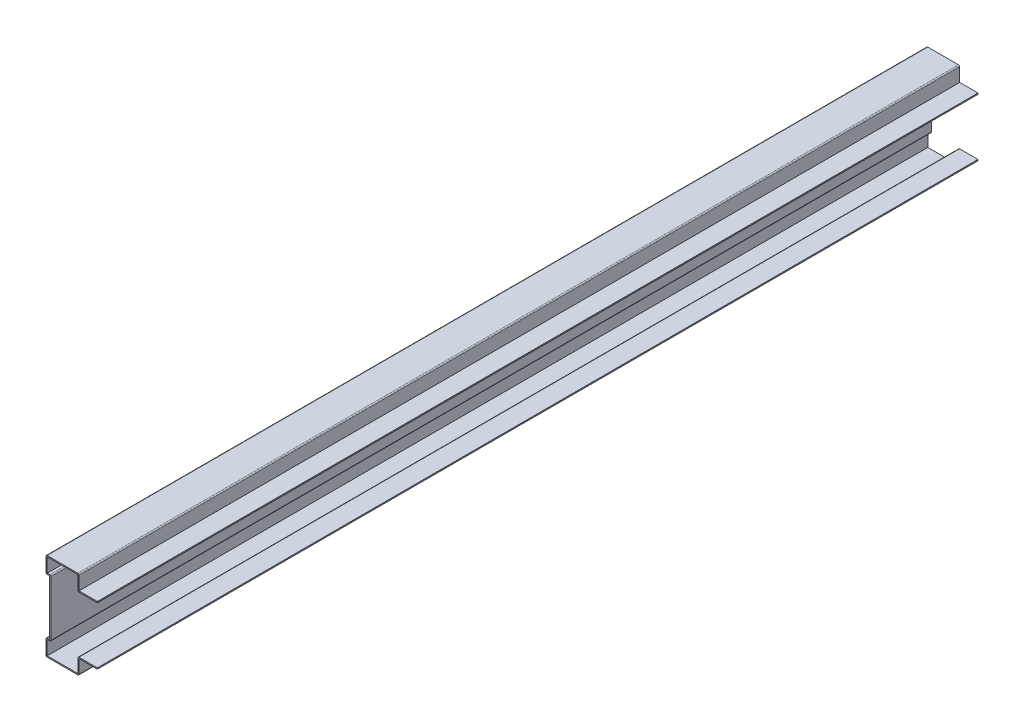
ISO-10303-21;
HEADER;
FILE_DESCRIPTION(('STEP AP214'),'2;1');
FILE_NAME('part.step','',(''),(''),'','','');
FILE_SCHEMA(('AUTOMOTIVE_DESIGN { 1 0 10303 214 1 1 1 1 }'));
ENDSEC;
DATA;
#1=APPLICATION_CONTEXT('core data for automotive mechanical design processes');
#2=APPLICATION_PROTOCOL_DEFINITION('international standard','automotive_design',2000,#1);
#3=PRODUCT_CONTEXT('',#1,'mechanical');
#4=PRODUCT('Part','Part','',(#3));
#5=PRODUCT_RELATED_PRODUCT_CATEGORY('part','',(#4));
#6=PRODUCT_DEFINITION_FORMATION('','',#4);
#7=PRODUCT_DEFINITION_CONTEXT('part definition',#1,'design');
#8=PRODUCT_DEFINITION('design','',#6,#7);
#9=PRODUCT_DEFINITION_SHAPE('','',#8);
#10=(LENGTH_UNIT() NAMED_UNIT(*) SI_UNIT(.MILLI.,.METRE.));
#11=(NAMED_UNIT(*) PLANE_ANGLE_UNIT() SI_UNIT($,.RADIAN.));
#12=(NAMED_UNIT(*) SI_UNIT($,.STERADIAN.) SOLID_ANGLE_UNIT());
#13=UNCERTAINTY_MEASURE_WITH_UNIT(LENGTH_MEASURE(1.E-05),#10,'distance_accuracy_value','');
#14=(GEOMETRIC_REPRESENTATION_CONTEXT(3) GLOBAL_UNCERTAINTY_ASSIGNED_CONTEXT((#13)) GLOBAL_UNIT_ASSIGNED_CONTEXT((#10,
#11,#12)) REPRESENTATION_CONTEXT('',''));
#15=CARTESIAN_POINT('',(0.,0.,0.));
#16=DIRECTION('',(0.,0.,1.));
#17=DIRECTION('',(1.,0.,0.));
#18=AXIS2_PLACEMENT_3D('',#15,#16,#17);
#19=CARTESIAN_POINT('',(-15.875,49.784,-762.));
#20=DIRECTION('',(0.,-1.,0.));
#21=DIRECTION('',(0.,0.,-1.));
#22=AXIS2_PLACEMENT_3D('',#19,#20,#21);
#23=PLANE('',#22);
#24=DIRECTION('',(1.,0.,0.));
#25=VECTOR('',#24,1.);
#26=CARTESIAN_POINT('',(-15.875,49.784,0.));
#27=LINE('',#26,#25);
#28=CARTESIAN_POINT('',(-15.875,49.784,0.));
#29=VERTEX_POINT('',#28);
#30=CARTESIAN_POINT('',(0.,49.784,0.));
#31=VERTEX_POINT('',#30);
#32=EDGE_CURVE('E431',#29,#31,#27,.T.);
#33=ORIENTED_EDGE('',*,*,#32,.F.);
#34=DIRECTION('',(0.,0.,1.));
#35=VECTOR('',#34,1.);
#36=CARTESIAN_POINT('',(-15.875,49.784,-762.));
#37=LINE('',#36,#35);
#38=CARTESIAN_POINT('',(-15.875,49.784,-762.));
#39=VERTEX_POINT('',#38);
#40=EDGE_CURVE('E11',#29,#39,#37,.F.);
#41=ORIENTED_EDGE('',*,*,#40,.T.);
#42=DIRECTION('',(1.,0.,0.));
#43=VECTOR('',#42,1.);
#44=CARTESIAN_POINT('',(-15.875,49.784,-762.));
#45=LINE('',#44,#43);
#46=CARTESIAN_POINT('',(0.,49.784,-762.));
#47=VERTEX_POINT('',#46);
#48=EDGE_CURVE('E257',#39,#47,#45,.T.);
#49=ORIENTED_EDGE('',*,*,#48,.T.);
#50=DIRECTION('',(0.,0.,1.));
#51=VECTOR('',#50,1.);
#52=CARTESIAN_POINT('',(0.,49.784,-762.));
#53=LINE('',#52,#51);
#54=EDGE_CURVE('E261',#47,#31,#53,.T.);
#55=ORIENTED_EDGE('',*,*,#54,.T.);
#56=EDGE_LOOP('',(#33,#41,#49,#55));
#57=FACE_BOUND('',#56,.T.);
#58=ADVANCED_FACE('F35',(#57),#23,.T.);
#59=CARTESIAN_POINT('',(-16.891,63.5,-762.));
#60=DIRECTION('',(-1.,0.,0.));
#61=DIRECTION('',(0.,0.,1.));
#62=AXIS2_PLACEMENT_3D('',#59,#60,#61);
#63=PLANE('',#62);
#64=DIRECTION('',(0.,1.,0.));
#65=VECTOR('',#64,1.);
#66=CARTESIAN_POINT('',(-16.891,63.5,-762.));
#67=LINE('',#66,#65);
#68=CARTESIAN_POINT('',(-16.891,62.484,-762.));
#69=VERTEX_POINT('',#68);
#70=CARTESIAN_POINT('',(-16.891,50.8,-762.));
#71=VERTEX_POINT('',#70);
#72=EDGE_CURVE('E281',#69,#71,#67,.F.);
#73=ORIENTED_EDGE('',*,*,#72,.T.);
#74=DIRECTION('',(0.,0.,1.));
#75=VECTOR('',#74,1.);
#76=CARTESIAN_POINT('',(-16.891,50.8,-762.));
#77=LINE('',#76,#75);
#78=CARTESIAN_POINT('',(-16.891,50.8,0.));
#79=VERTEX_POINT('',#78);
#80=EDGE_CURVE('E43',#71,#79,#77,.T.);
#81=ORIENTED_EDGE('',*,*,#80,.T.);
#82=DIRECTION('',(0.,1.,0.));
#83=VECTOR('',#82,1.);
#84=CARTESIAN_POINT('',(-16.891,63.5,0.));
#85=LINE('',#84,#83);
#86=CARTESIAN_POINT('',(-16.891,62.484,0.));
#87=VERTEX_POINT('',#86);
#88=EDGE_CURVE('E266',#87,#79,#85,.F.);
#89=ORIENTED_EDGE('',*,*,#88,.F.);
#90=DIRECTION('',(0.,0.,1.));
#91=VECTOR('',#90,1.);
#92=CARTESIAN_POINT('',(-16.891,62.484,-762.));
#93=LINE('',#92,#91);
#94=EDGE_CURVE('E294',#69,#87,#93,.T.);
#95=ORIENTED_EDGE('',*,*,#94,.F.);
#96=EDGE_LOOP('',(#73,#81,#89,#95));
#97=FACE_BOUND('',#96,.T.);
#98=ADVANCED_FACE('F378',(#97),#63,.T.);
#99=CARTESIAN_POINT('',(-44.45,62.484,-762.));
#100=DIRECTION('',(0.,-1.,0.));
#101=DIRECTION('',(0.,0.,-1.));
#102=AXIS2_PLACEMENT_3D('',#99,#100,#101);
#103=PLANE('',#102);
#104=DIRECTION('',(1.,0.,0.));
#105=VECTOR('',#104,1.);
#106=CARTESIAN_POINT('',(-44.45,62.484,0.));
#107=LINE('',#106,#105);
#108=CARTESIAN_POINT('',(-43.434,62.484,0.));
#109=VERTEX_POINT('',#108);
#110=EDGE_CURVE('E387',#109,#87,#107,.T.);
#111=ORIENTED_EDGE('',*,*,#110,.F.);
#112=DIRECTION('',(0.,0.,1.));
#113=VECTOR('',#112,1.);
#114=CARTESIAN_POINT('',(-43.434,62.484,-762.));
#115=LINE('',#114,#113);
#116=CARTESIAN_POINT('',(-43.434,62.484,-762.));
#117=VERTEX_POINT('',#116);
#118=EDGE_CURVE('E394',#117,#109,#115,.T.);
#119=ORIENTED_EDGE('',*,*,#118,.F.);
#120=DIRECTION('',(1.,0.,0.));
#121=VECTOR('',#120,1.);
#122=CARTESIAN_POINT('',(-44.45,62.484,-762.));
#123=LINE('',#122,#121);
#124=EDGE_CURVE('E286',#117,#69,#123,.T.);
#125=ORIENTED_EDGE('',*,*,#124,.T.);
#126=ORIENTED_EDGE('',*,*,#94,.T.);
#127=EDGE_LOOP('',(#111,#119,#125,#126));
#128=FACE_BOUND('',#127,.T.);
#129=ADVANCED_FACE('F487',(#128),#103,.T.);
#130=CARTESIAN_POINT('',(-43.434,49.2125,-762.));
#131=DIRECTION('',(1.,0.,0.));
#132=DIRECTION('',(0.,0.,-1.));
#133=AXIS2_PLACEMENT_3D('',#130,#131,#132);
#134=PLANE('',#133);
#135=DIRECTION('',(0.,1.,0.));
#136=VECTOR('',#135,1.);
#137=CARTESIAN_POINT('',(-43.434,49.2125,0.));
#138=LINE('',#137,#136);
#139=CARTESIAN_POINT('',(-43.434,50.2285,0.));
#140=VERTEX_POINT('',#139);
#141=EDGE_CURVE('E389',#140,#109,#138,.T.);
#142=ORIENTED_EDGE('',*,*,#141,.F.);
#143=DIRECTION('',(0.,0.,1.));
#144=VECTOR('',#143,1.);
#145=CARTESIAN_POINT('',(-43.434,50.2285,-762.));
#146=LINE('',#145,#144);
#147=CARTESIAN_POINT('',(-43.434,50.2285,-762.));
#148=VERTEX_POINT('',#147);
#149=EDGE_CURVE('E396',#148,#140,#146,.T.);
#150=ORIENTED_EDGE('',*,*,#149,.F.);
#151=DIRECTION('',(0.,1.,0.));
#152=VECTOR('',#151,1.);
#153=CARTESIAN_POINT('',(-43.434,49.2125,-762.));
#154=LINE('',#153,#152);
#155=EDGE_CURVE('E483',#148,#117,#154,.T.);
#156=ORIENTED_EDGE('',*,*,#155,.T.);
#157=ORIENTED_EDGE('',*,*,#118,.T.);
#158=EDGE_LOOP('',(#142,#150,#156,#157));
#159=FACE_BOUND('',#158,.T.);
#160=ADVANCED_FACE('F480',(#159),#134,.T.);
#161=CARTESIAN_POINT('',(-41.275,50.2285,-762.));
#162=DIRECTION('',(0.,1.,0.));
#163=DIRECTION('',(0.,0.,1.));
#164=AXIS2_PLACEMENT_3D('',#161,#162,#163);
#165=PLANE('',#164);
#166=DIRECTION('',(1.,0.,0.));
#167=VECTOR('',#166,1.);
#168=CARTESIAN_POINT('',(-41.275,50.2285,0.));
#169=LINE('',#168,#167);
#170=CARTESIAN_POINT('',(-41.275,50.2285,0.));
#171=VERTEX_POINT('',#170);
#172=EDGE_CURVE('E475',#171,#140,#169,.F.);
#173=ORIENTED_EDGE('',*,*,#172,.F.);
#174=DIRECTION('',(0.,0.,1.));
#175=VECTOR('',#174,1.);
#176=CARTESIAN_POINT('',(-41.275,50.2285,-762.));
#177=LINE('',#176,#175);
#178=CARTESIAN_POINT('',(-41.275,50.2285,-762.));
#179=VERTEX_POINT('',#178);
#180=EDGE_CURVE('E358',#171,#179,#177,.F.);
#181=ORIENTED_EDGE('',*,*,#180,.T.);
#182=DIRECTION('',(1.,0.,0.));
#183=VECTOR('',#182,1.);
#184=CARTESIAN_POINT('',(-41.275,50.2285,-762.));
#185=LINE('',#184,#183);
#186=EDGE_CURVE('E589',#179,#148,#185,.F.);
#187=ORIENTED_EDGE('',*,*,#186,.T.);
#188=ORIENTED_EDGE('',*,*,#149,.T.);
#189=EDGE_LOOP('',(#173,#181,#187,#188));
#190=FACE_BOUND('',#189,.T.);
#191=ADVANCED_FACE('F593',(#190),#165,.T.);
#192=CARTESIAN_POINT('',(-40.259,1.5875,-762.));
#193=DIRECTION('',(1.,0.,0.));
#194=DIRECTION('',(0.,0.,-1.));
#195=AXIS2_PLACEMENT_3D('',#192,#193,#194);
#196=PLANE('',#195);
#197=DIRECTION('',(0.,1.,0.));
#198=VECTOR('',#197,1.);
#199=CARTESIAN_POINT('',(-40.259,1.5875,0.));
#200=LINE('',#199,#198);
#201=CARTESIAN_POINT('',(-40.259,1.5875,0.));
#202=VERTEX_POINT('',#201);
#203=CARTESIAN_POINT('',(-40.259,49.2125,0.));
#204=VERTEX_POINT('',#203);
#205=EDGE_CURVE('E472',#202,#204,#200,.T.);
#206=ORIENTED_EDGE('',*,*,#205,.F.);
#207=DIRECTION('',(0.,0.,1.));
#208=VECTOR('',#207,1.);
#209=CARTESIAN_POINT('',(-40.259,1.5875,-762.));
#210=LINE('',#209,#208);
#211=CARTESIAN_POINT('',(-40.259,1.5875,-762.));
#212=VERTEX_POINT('',#211);
#213=EDGE_CURVE('E356',#202,#212,#210,.F.);
#214=ORIENTED_EDGE('',*,*,#213,.T.);
#215=DIRECTION('',(0.,1.,0.));
#216=VECTOR('',#215,1.);
#217=CARTESIAN_POINT('',(-40.259,1.5875,-762.));
#218=LINE('',#217,#216);
#219=CARTESIAN_POINT('',(-40.259,49.2125,-762.));
#220=VERTEX_POINT('',#219);
#221=EDGE_CURVE('E586',#212,#220,#218,.T.);
#222=ORIENTED_EDGE('',*,*,#221,.T.);
#223=DIRECTION('',(0.,0.,1.));
#224=VECTOR('',#223,1.);
#225=CARTESIAN_POINT('',(-40.259,49.2125,-762.));
#226=LINE('',#225,#224);
#227=EDGE_CURVE('E353',#220,#204,#226,.T.);
#228=ORIENTED_EDGE('',*,*,#227,.T.);
#229=EDGE_LOOP('',(#206,#214,#222,#228));
#230=FACE_BOUND('',#229,.T.);
#231=ADVANCED_FACE('F600',(#230),#196,.T.);
#232=CARTESIAN_POINT('',(-44.45,0.571499999999999,-762.));
#233=DIRECTION('',(0.,-1.,0.));
#234=DIRECTION('',(0.,0.,-1.));
#235=AXIS2_PLACEMENT_3D('',#232,#233,#234);
#236=PLANE('',#235);
#237=DIRECTION('',(1.,0.,0.));
#238=VECTOR('',#237,1.);
#239=CARTESIAN_POINT('',(-44.45,0.571499999999999,-762.));
#240=LINE('',#239,#238);
#241=CARTESIAN_POINT('',(-43.434,0.571499999999999,-762.));
#242=VERTEX_POINT('',#241);
#243=CARTESIAN_POINT('',(-41.275,0.571499999999999,-762.));
#244=VERTEX_POINT('',#243);
#245=EDGE_CURVE('E583',#242,#244,#240,.T.);
#246=ORIENTED_EDGE('',*,*,#245,.T.);
#247=DIRECTION('',(0.,0.,1.));
#248=VECTOR('',#247,1.);
#249=CARTESIAN_POINT('',(-41.275,0.571499999999999,-762.));
#250=LINE('',#249,#248);
#251=CARTESIAN_POINT('',(-41.275,0.571499999999999,0.));
#252=VERTEX_POINT('',#251);
#253=EDGE_CURVE('E350',#244,#252,#250,.T.);
#254=ORIENTED_EDGE('',*,*,#253,.T.);
#255=DIRECTION('',(1.,0.,0.));
#256=VECTOR('',#255,1.);
#257=CARTESIAN_POINT('',(-44.45,0.571499999999999,0.));
#258=LINE('',#257,#256);
#259=CARTESIAN_POINT('',(-43.434,0.571499999999999,0.));
#260=VERTEX_POINT('',#259);
#261=EDGE_CURVE('E469',#260,#252,#258,.T.);
#262=ORIENTED_EDGE('',*,*,#261,.F.);
#263=DIRECTION('',(0.,0.,1.));
#264=VECTOR('',#263,1.);
#265=CARTESIAN_POINT('',(-43.434,0.571499999999999,-762.));
#266=LINE('',#265,#264);
#267=EDGE_CURVE('E399',#242,#260,#266,.T.);
#268=ORIENTED_EDGE('',*,*,#267,.F.);
#269=EDGE_LOOP('',(#246,#254,#262,#268));
#270=FACE_BOUND('',#269,.T.);
#271=ADVANCED_FACE('F606',(#270),#236,.T.);
#272=CARTESIAN_POINT('',(-43.434,-12.7,-762.));
#273=DIRECTION('',(1.,0.,0.));
#274=DIRECTION('',(0.,0.,-1.));
#275=AXIS2_PLACEMENT_3D('',#272,#273,#274);
#276=PLANE('',#275);
#277=DIRECTION('',(0.,1.,0.));
#278=VECTOR('',#277,1.);
#279=CARTESIAN_POINT('',(-43.434,-12.7,0.));
#280=LINE('',#279,#278);
#281=CARTESIAN_POINT('',(-43.434,-11.684,0.));
#282=VERTEX_POINT('',#281);
#283=EDGE_CURVE('E466',#282,#260,#280,.T.);
#284=ORIENTED_EDGE('',*,*,#283,.F.);
#285=DIRECTION('',(0.,0.,1.));
#286=VECTOR('',#285,1.);
#287=CARTESIAN_POINT('',(-43.434,-11.684,-762.));
#288=LINE('',#287,#286);
#289=CARTESIAN_POINT('',(-43.434,-11.684,-762.));
#290=VERTEX_POINT('',#289);
#291=EDGE_CURVE('E401',#290,#282,#288,.T.);
#292=ORIENTED_EDGE('',*,*,#291,.F.);
#293=DIRECTION('',(0.,1.,0.));
#294=VECTOR('',#293,1.);
#295=CARTESIAN_POINT('',(-43.434,-12.7,-762.));
#296=LINE('',#295,#294);
#297=EDGE_CURVE('E580',#290,#242,#296,.T.);
#298=ORIENTED_EDGE('',*,*,#297,.T.);
#299=ORIENTED_EDGE('',*,*,#267,.T.);
#300=EDGE_LOOP('',(#284,#292,#298,#299));
#301=FACE_BOUND('',#300,.T.);
#302=ADVANCED_FACE('F612',(#301),#276,.T.);
#303=CARTESIAN_POINT('',(-15.875,-11.684,-762.));
#304=DIRECTION('',(0.,1.,0.));
#305=DIRECTION('',(0.,0.,1.));
#306=AXIS2_PLACEMENT_3D('',#303,#304,#305);
#307=PLANE('',#306);
#308=DIRECTION('',(1.,0.,0.));
#309=VECTOR('',#308,1.);
#310=CARTESIAN_POINT('',(-15.875,-11.684,0.));
#311=LINE('',#310,#309);
#312=CARTESIAN_POINT('',(-16.891,-11.684,0.));
#313=VERTEX_POINT('',#312);
#314=EDGE_CURVE('E463',#313,#282,#311,.F.);
#315=ORIENTED_EDGE('',*,*,#314,.F.);
#316=DIRECTION('',(0.,0.,1.));
#317=VECTOR('',#316,1.);
#318=CARTESIAN_POINT('',(-16.891,-11.684,-762.));
#319=LINE('',#318,#317);
#320=CARTESIAN_POINT('',(-16.891,-11.684,-762.));
#321=VERTEX_POINT('',#320);
#322=EDGE_CURVE('E403',#321,#313,#319,.T.);
#323=ORIENTED_EDGE('',*,*,#322,.F.);
#324=DIRECTION('',(1.,0.,0.));
#325=VECTOR('',#324,1.);
#326=CARTESIAN_POINT('',(-15.875,-11.684,-762.));
#327=LINE('',#326,#325);
#328=EDGE_CURVE('E577',#321,#290,#327,.F.);
#329=ORIENTED_EDGE('',*,*,#328,.T.);
#330=ORIENTED_EDGE('',*,*,#291,.T.);
#331=EDGE_LOOP('',(#315,#323,#329,#330));
#332=FACE_BOUND('',#331,.T.);
#333=ADVANCED_FACE('F615',(#332),#307,.T.);
#334=CARTESIAN_POINT('',(-16.891,0.,-762.));
#335=DIRECTION('',(-1.,0.,0.));
#336=DIRECTION('',(0.,-1.,0.));
#337=AXIS2_PLACEMENT_3D('',#334,#335,#336);
#338=PLANE('',#337);
#339=DIRECTION('',(0.,-1.,0.));
#340=VECTOR('',#339,1.);
#341=CARTESIAN_POINT('',(-16.891,0.,0.));
#342=LINE('',#341,#340);
#343=CARTESIAN_POINT('',(-16.891,0.,0.));
#344=VERTEX_POINT('',#343);
#345=EDGE_CURVE('E461',#344,#313,#342,.T.);
#346=ORIENTED_EDGE('',*,*,#345,.F.);
#347=DIRECTION('',(0.,0.,1.));
#348=VECTOR('',#347,1.);
#349=CARTESIAN_POINT('',(-16.891,0.,-762.));
#350=LINE('',#349,#348);
#351=CARTESIAN_POINT('',(-16.891,0.,-762.));
#352=VERTEX_POINT('',#351);
#353=EDGE_CURVE('E314',#344,#352,#350,.F.);
#354=ORIENTED_EDGE('',*,*,#353,.T.);
#355=DIRECTION('',(0.,-1.,0.));
#356=VECTOR('',#355,1.);
#357=CARTESIAN_POINT('',(-16.891,0.,-762.));
#358=LINE('',#357,#356);
#359=EDGE_CURVE('E575',#352,#321,#358,.T.);
#360=ORIENTED_EDGE('',*,*,#359,.T.);
#361=ORIENTED_EDGE('',*,*,#322,.T.);
#362=EDGE_LOOP('',(#346,#354,#360,#361));
#363=FACE_BOUND('',#362,.T.);
#364=ADVANCED_FACE('F707',(#363),#338,.T.);
#365=CARTESIAN_POINT('',(0.,1.016,-762.));
#366=DIRECTION('',(0.,1.,0.));
#367=DIRECTION('',(0.,0.,1.));
#368=AXIS2_PLACEMENT_3D('',#365,#366,#367);
#369=PLANE('',#368);
#370=DIRECTION('',(1.,0.,0.));
#371=VECTOR('',#370,1.);
#372=CARTESIAN_POINT('',(0.,1.016,-762.));
#373=LINE('',#372,#371);
#374=CARTESIAN_POINT('',(0.,1.016,-762.));
#375=VERTEX_POINT('',#374);
#376=CARTESIAN_POINT('',(-15.875,1.016,-762.));
#377=VERTEX_POINT('',#376);
#378=EDGE_CURVE('E572',#375,#377,#373,.F.);
#379=ORIENTED_EDGE('',*,*,#378,.T.);
#380=DIRECTION('',(0.,0.,1.));
#381=VECTOR('',#380,1.);
#382=CARTESIAN_POINT('',(-15.875,1.016,-762.));
#383=LINE('',#382,#381);
#384=CARTESIAN_POINT('',(-15.875,1.016,0.));
#385=VERTEX_POINT('',#384);
#386=EDGE_CURVE('E290',#377,#385,#383,.T.);
#387=ORIENTED_EDGE('',*,*,#386,.T.);
#388=DIRECTION('',(1.,0.,0.));
#389=VECTOR('',#388,1.);
#390=CARTESIAN_POINT('',(0.,1.016,0.));
#391=LINE('',#390,#389);
#392=CARTESIAN_POINT('',(0.,1.016,0.));
#393=VERTEX_POINT('',#392);
#394=EDGE_CURVE('E459',#393,#385,#391,.F.);
#395=ORIENTED_EDGE('',*,*,#394,.F.);
#396=DIRECTION('',(0.,0.,1.));
#397=VECTOR('',#396,1.);
#398=CARTESIAN_POINT('',(0.,1.016,-762.));
#399=LINE('',#398,#397);
#400=EDGE_CURVE('E406',#375,#393,#399,.T.);
#401=ORIENTED_EDGE('',*,*,#400,.F.);
#402=EDGE_LOOP('',(#379,#387,#395,#401));
#403=FACE_BOUND('',#402,.T.);
#404=ADVANCED_FACE('F624',(#403),#369,.T.);
#405=CARTESIAN_POINT('',(0.,1.016,-762.));
#406=DIRECTION('',(-1.,0.,0.));
#407=DIRECTION('',(0.,0.,1.));
#408=AXIS2_PLACEMENT_3D('',#405,#406,#407);
#409=PLANE('',#408);
#410=DIRECTION('',(0.,-1.,0.));
#411=VECTOR('',#410,1.);
#412=CARTESIAN_POINT('',(0.,1.016,0.));
#413=LINE('',#412,#411);
#414=CARTESIAN_POINT('',(0.,0.,0.));
#415=VERTEX_POINT('',#414);
#416=EDGE_CURVE('E457',#393,#415,#413,.T.);
#417=ORIENTED_EDGE('',*,*,#416,.T.);
#418=DIRECTION('',(0.,0.,1.));
#419=VECTOR('',#418,1.);
#420=CARTESIAN_POINT('',(0.,0.,-762.));
#421=LINE('',#420,#419);
#422=CARTESIAN_POINT('',(0.,0.,-762.));
#423=VERTEX_POINT('',#422);
#424=EDGE_CURVE('E408',#423,#415,#421,.T.);
#425=ORIENTED_EDGE('',*,*,#424,.F.);
#426=DIRECTION('',(0.,-1.,0.));
#427=VECTOR('',#426,1.);
#428=CARTESIAN_POINT('',(0.,1.016,-762.));
#429=LINE('',#428,#427);
#430=EDGE_CURVE('E570',#375,#423,#429,.T.);
#431=ORIENTED_EDGE('',*,*,#430,.F.);
#432=ORIENTED_EDGE('',*,*,#400,.T.);
#433=EDGE_LOOP('',(#417,#425,#431,#432));
#434=FACE_BOUND('',#433,.T.);
#435=ADVANCED_FACE('F631',(#434),#409,.F.);
#436=CARTESIAN_POINT('',(0.,0.,-762.));
#437=DIRECTION('',(0.,1.,0.));
#438=DIRECTION('',(0.,0.,1.));
#439=AXIS2_PLACEMENT_3D('',#436,#437,#438);
#440=PLANE('',#439);
#441=DIRECTION('',(-1.,0.,0.));
#442=VECTOR('',#441,1.);
#443=CARTESIAN_POINT('',(0.,0.,0.));
#444=LINE('',#443,#442);
#445=CARTESIAN_POINT('',(-15.875,0.,0.));
#446=VERTEX_POINT('',#445);
#447=EDGE_CURVE('E455',#415,#446,#444,.T.);
#448=ORIENTED_EDGE('',*,*,#447,.T.);
#449=DIRECTION('',(0.,0.,1.));
#450=VECTOR('',#449,1.);
#451=CARTESIAN_POINT('',(-15.875,0.,-762.));
#452=LINE('',#451,#450);
#453=CARTESIAN_POINT('',(-15.875,0.,-762.));
#454=VERTEX_POINT('',#453);
#455=EDGE_CURVE('E411',#454,#446,#452,.T.);
#456=ORIENTED_EDGE('',*,*,#455,.F.);
#457=DIRECTION('',(-1.,0.,0.));
#458=VECTOR('',#457,1.);
#459=CARTESIAN_POINT('',(0.,0.,-762.));
#460=LINE('',#459,#458);
#461=EDGE_CURVE('E568',#423,#454,#460,.T.);
#462=ORIENTED_EDGE('',*,*,#461,.F.);
#463=ORIENTED_EDGE('',*,*,#424,.T.);
#464=EDGE_LOOP('',(#448,#456,#462,#463));
#465=FACE_BOUND('',#464,.T.);
#466=ADVANCED_FACE('F635',(#465),#440,.F.);
#467=CARTESIAN_POINT('',(-15.875,0.,-762.));
#468=DIRECTION('',(-1.,0.,0.));
#469=DIRECTION('',(0.,-1.,0.));
#470=AXIS2_PLACEMENT_3D('',#467,#468,#469);
#471=PLANE('',#470);
#472=DIRECTION('',(0.,-1.,0.));
#473=VECTOR('',#472,1.);
#474=CARTESIAN_POINT('',(-15.875,0.,0.));
#475=LINE('',#474,#473);
#476=CARTESIAN_POINT('',(-15.875,-11.684,0.));
#477=VERTEX_POINT('',#476);
#478=EDGE_CURVE('E452',#446,#477,#475,.T.);
#479=ORIENTED_EDGE('',*,*,#478,.T.);
#480=DIRECTION('',(0.,0.,1.));
#481=VECTOR('',#480,1.);
#482=CARTESIAN_POINT('',(-15.875,-11.684,-762.));
#483=LINE('',#482,#481);
#484=CARTESIAN_POINT('',(-15.875,-11.684,-762.));
#485=VERTEX_POINT('',#484);
#486=EDGE_CURVE('E340',#477,#485,#483,.F.);
#487=ORIENTED_EDGE('',*,*,#486,.T.);
#488=DIRECTION('',(0.,-1.,0.));
#489=VECTOR('',#488,1.);
#490=CARTESIAN_POINT('',(-15.875,0.,-762.));
#491=LINE('',#490,#489);
#492=EDGE_CURVE('E565',#454,#485,#491,.T.);
#493=ORIENTED_EDGE('',*,*,#492,.F.);
#494=ORIENTED_EDGE('',*,*,#455,.T.);
#495=EDGE_LOOP('',(#479,#487,#493,#494));
#496=FACE_BOUND('',#495,.T.);
#497=ADVANCED_FACE('F698',(#496),#471,.F.);
#498=CARTESIAN_POINT('',(-15.875,-12.7,-762.));
#499=DIRECTION('',(0.,1.,0.));
#500=DIRECTION('',(0.,0.,1.));
#501=AXIS2_PLACEMENT_3D('',#498,#499,#500);
#502=PLANE('',#501);
#503=DIRECTION('',(-1.,0.,0.));
#504=VECTOR('',#503,1.);
#505=CARTESIAN_POINT('',(-15.875,-12.7,-762.));
#506=LINE('',#505,#504);
#507=CARTESIAN_POINT('',(-16.891,-12.7,-762.));
#508=VERTEX_POINT('',#507);
#509=CARTESIAN_POINT('',(-43.434,-12.7,-762.));
#510=VERTEX_POINT('',#509);
#511=EDGE_CURVE('E562',#508,#510,#506,.T.);
#512=ORIENTED_EDGE('',*,*,#511,.F.);
#513=DIRECTION('',(0.,0.,1.));
#514=VECTOR('',#513,1.);
#515=CARTESIAN_POINT('',(-16.891,-12.7,-762.));
#516=LINE('',#515,#514);
#517=CARTESIAN_POINT('',(-16.891,-12.7,0.));
#518=VERTEX_POINT('',#517);
#519=EDGE_CURVE('E337',#508,#518,#516,.T.);
#520=ORIENTED_EDGE('',*,*,#519,.T.);
#521=DIRECTION('',(-1.,0.,0.));
#522=VECTOR('',#521,1.);
#523=CARTESIAN_POINT('',(-15.875,-12.7,0.));
#524=LINE('',#523,#522);
#525=CARTESIAN_POINT('',(-43.434,-12.7,0.));
#526=VERTEX_POINT('',#525);
#527=EDGE_CURVE('E449',#518,#526,#524,.T.);
#528=ORIENTED_EDGE('',*,*,#527,.T.);
#529=DIRECTION('',(0.,0.,1.));
#530=VECTOR('',#529,1.);
#531=CARTESIAN_POINT('',(-43.434,-12.7,-762.));
#532=LINE('',#531,#530);
#533=EDGE_CURVE('E335',#526,#510,#532,.F.);
#534=ORIENTED_EDGE('',*,*,#533,.T.);
#535=EDGE_LOOP('',(#512,#520,#528,#534));
#536=FACE_BOUND('',#535,.T.);
#537=ADVANCED_FACE('F645',(#536),#502,.F.);
#538=CARTESIAN_POINT('',(-44.45,-12.7,-762.));
#539=DIRECTION('',(1.,0.,0.));
#540=DIRECTION('',(0.,0.,-1.));
#541=AXIS2_PLACEMENT_3D('',#538,#539,#540);
#542=PLANE('',#541);
#543=DIRECTION('',(0.,1.,0.));
#544=VECTOR('',#543,1.);
#545=CARTESIAN_POINT('',(-44.45,-12.7,-762.));
#546=LINE('',#545,#544);
#547=CARTESIAN_POINT('',(-44.45,-11.684,-762.));
#548=VERTEX_POINT('',#547);
#549=CARTESIAN_POINT('',(-44.45,0.571499999999996,-762.));
#550=VERTEX_POINT('',#549);
#551=EDGE_CURVE('E559',#548,#550,#546,.T.);
#552=ORIENTED_EDGE('',*,*,#551,.F.);
#553=DIRECTION('',(0.,0.,1.));
#554=VECTOR('',#553,1.);
#555=CARTESIAN_POINT('',(-44.45,-11.684,-762.));
#556=LINE('',#555,#554);
#557=CARTESIAN_POINT('',(-44.45,-11.684,0.));
#558=VERTEX_POINT('',#557);
#559=EDGE_CURVE('E344',#548,#558,#556,.T.);
#560=ORIENTED_EDGE('',*,*,#559,.T.);
#561=DIRECTION('',(0.,1.,0.));
#562=VECTOR('',#561,1.);
#563=CARTESIAN_POINT('',(-44.45,-12.7,0.));
#564=LINE('',#563,#562);
#565=CARTESIAN_POINT('',(-44.45,0.571499999999996,0.));
#566=VERTEX_POINT('',#565);
#567=EDGE_CURVE('E446',#558,#566,#564,.T.);
#568=ORIENTED_EDGE('',*,*,#567,.T.);
#569=DIRECTION('',(0.,0.,1.));
#570=VECTOR('',#569,1.);
#571=CARTESIAN_POINT('',(-44.45,0.571499999999999,-762.));
#572=LINE('',#571,#570);
#573=EDGE_CURVE('E342',#566,#550,#572,.F.);
#574=ORIENTED_EDGE('',*,*,#573,.T.);
#575=EDGE_LOOP('',(#552,#560,#568,#574));
#576=FACE_BOUND('',#575,.T.);
#577=ADVANCED_FACE('F652',(#576),#542,.F.);
#578=CARTESIAN_POINT('',(-44.45,1.5875,-762.));
#579=DIRECTION('',(0.,-1.,0.));
#580=DIRECTION('',(0.,0.,-1.));
#581=AXIS2_PLACEMENT_3D('',#578,#579,#580);
#582=PLANE('',#581);
#583=DIRECTION('',(1.,0.,0.));
#584=VECTOR('',#583,1.);
#585=CARTESIAN_POINT('',(-44.45,1.5875,-762.));
#586=LINE('',#585,#584);
#587=CARTESIAN_POINT('',(-43.434,1.5875,-762.));
#588=VERTEX_POINT('',#587);
#589=CARTESIAN_POINT('',(-41.275,1.5875,-762.));
#590=VERTEX_POINT('',#589);
#591=EDGE_CURVE('E557',#588,#590,#586,.T.);
#592=ORIENTED_EDGE('',*,*,#591,.F.);
#593=DIRECTION('',(0.,0.,1.));
#594=VECTOR('',#593,1.);
#595=CARTESIAN_POINT('',(-43.434,1.5875,-762.));
#596=LINE('',#595,#594);
#597=CARTESIAN_POINT('',(-43.434,1.5875,0.));
#598=VERTEX_POINT('',#597);
#599=EDGE_CURVE('E347',#588,#598,#596,.T.);
#600=ORIENTED_EDGE('',*,*,#599,.T.);
#601=DIRECTION('',(1.,0.,0.));
#602=VECTOR('',#601,1.);
#603=CARTESIAN_POINT('',(-44.45,1.5875,0.));
#604=LINE('',#603,#602);
#605=CARTESIAN_POINT('',(-41.275,1.5875,0.));
#606=VERTEX_POINT('',#605);
#607=EDGE_CURVE('E444',#598,#606,#604,.T.);
#608=ORIENTED_EDGE('',*,*,#607,.T.);
#609=DIRECTION('',(0.,0.,1.));
#610=VECTOR('',#609,1.);
#611=CARTESIAN_POINT('',(-41.275,1.5875,-762.));
#612=LINE('',#611,#610);
#613=EDGE_CURVE('E414',#590,#606,#612,.T.);
#614=ORIENTED_EDGE('',*,*,#613,.F.);
#615=EDGE_LOOP('',(#592,#600,#608,#614));
#616=FACE_BOUND('',#615,.T.);
#617=ADVANCED_FACE('F659',(#616),#582,.F.);
#618=CARTESIAN_POINT('',(-41.275,1.5875,-762.));
#619=DIRECTION('',(1.,0.,0.));
#620=DIRECTION('',(0.,0.,-1.));
#621=AXIS2_PLACEMENT_3D('',#618,#619,#620);
#622=PLANE('',#621);
#623=DIRECTION('',(0.,1.,0.));
#624=VECTOR('',#623,1.);
#625=CARTESIAN_POINT('',(-41.275,1.5875,0.));
#626=LINE('',#625,#624);
#627=CARTESIAN_POINT('',(-41.275,49.2125,0.));
#628=VERTEX_POINT('',#627);
#629=EDGE_CURVE('E442',#606,#628,#626,.T.);
#630=ORIENTED_EDGE('',*,*,#629,.T.);
#631=DIRECTION('',(0.,0.,1.));
#632=VECTOR('',#631,1.);
#633=CARTESIAN_POINT('',(-41.275,49.2125,-762.));
#634=LINE('',#633,#632);
#635=CARTESIAN_POINT('',(-41.275,49.2125,-762.));
#636=VERTEX_POINT('',#635);
#637=EDGE_CURVE('E417',#636,#628,#634,.T.);
#638=ORIENTED_EDGE('',*,*,#637,.F.);
#639=DIRECTION('',(0.,1.,0.));
#640=VECTOR('',#639,1.);
#641=CARTESIAN_POINT('',(-41.275,1.5875,-762.));
#642=LINE('',#641,#640);
#643=EDGE_CURVE('E555',#590,#636,#642,.T.);
#644=ORIENTED_EDGE('',*,*,#643,.F.);
#645=ORIENTED_EDGE('',*,*,#613,.T.);
#646=EDGE_LOOP('',(#630,#638,#644,#645));
#647=FACE_BOUND('',#646,.T.);
#648=ADVANCED_FACE('F665',(#647),#622,.F.);
#649=CARTESIAN_POINT('',(-41.275,49.2125,-762.));
#650=DIRECTION('',(0.,1.,0.));
#651=DIRECTION('',(0.,0.,1.));
#652=AXIS2_PLACEMENT_3D('',#649,#650,#651);
#653=PLANE('',#652);
#654=DIRECTION('',(-1.,0.,0.));
#655=VECTOR('',#654,1.);
#656=CARTESIAN_POINT('',(-41.275,49.2125,0.));
#657=LINE('',#656,#655);
#658=CARTESIAN_POINT('',(-43.434,49.2125,0.));
#659=VERTEX_POINT('',#658);
#660=EDGE_CURVE('E439',#628,#659,#657,.T.);
#661=ORIENTED_EDGE('',*,*,#660,.T.);
#662=DIRECTION('',(0.,0.,1.));
#663=VECTOR('',#662,1.);
#664=CARTESIAN_POINT('',(-43.434,49.2125,-762.));
#665=LINE('',#664,#663);
#666=CARTESIAN_POINT('',(-43.434,49.2125,-762.));
#667=VERTEX_POINT('',#666);
#668=EDGE_CURVE('E365',#659,#667,#665,.F.);
#669=ORIENTED_EDGE('',*,*,#668,.T.);
#670=DIRECTION('',(-1.,0.,0.));
#671=VECTOR('',#670,1.);
#672=CARTESIAN_POINT('',(-41.275,49.2125,-762.));
#673=LINE('',#672,#671);
#674=EDGE_CURVE('E548',#636,#667,#673,.T.);
#675=ORIENTED_EDGE('',*,*,#674,.F.);
#676=ORIENTED_EDGE('',*,*,#637,.T.);
#677=EDGE_LOOP('',(#661,#669,#675,#676));
#678=FACE_BOUND('',#677,.T.);
#679=ADVANCED_FACE('F669',(#678),#653,.F.);
#680=CARTESIAN_POINT('',(-44.45,49.2125,-762.));
#681=DIRECTION('',(1.,0.,0.));
#682=DIRECTION('',(0.,0.,-1.));
#683=AXIS2_PLACEMENT_3D('',#680,#681,#682);
#684=PLANE('',#683);
#685=DIRECTION('',(0.,1.,0.));
#686=VECTOR('',#685,1.);
#687=CARTESIAN_POINT('',(-44.45,49.2125,-762.));
#688=LINE('',#687,#686);
#689=CARTESIAN_POINT('',(-44.45,50.2285,-762.));
#690=VERTEX_POINT('',#689);
#691=CARTESIAN_POINT('',(-44.45,62.484,-762.));
#692=VERTEX_POINT('',#691);
#693=EDGE_CURVE('E543',#690,#692,#688,.T.);
#694=ORIENTED_EDGE('',*,*,#693,.F.);
#695=DIRECTION('',(0.,0.,1.));
#696=VECTOR('',#695,1.);
#697=CARTESIAN_POINT('',(-44.45,50.2285,-762.));
#698=LINE('',#697,#696);
#699=CARTESIAN_POINT('',(-44.45,50.2285,0.));
#700=VERTEX_POINT('',#699);
#701=EDGE_CURVE('E362',#690,#700,#698,.T.);
#702=ORIENTED_EDGE('',*,*,#701,.T.);
#703=DIRECTION('',(0.,1.,0.));
#704=VECTOR('',#703,1.);
#705=CARTESIAN_POINT('',(-44.45,49.2125,0.));
#706=LINE('',#705,#704);
#707=CARTESIAN_POINT('',(-44.45,62.484,0.));
#708=VERTEX_POINT('',#707);
#709=EDGE_CURVE('E436',#700,#708,#706,.T.);
#710=ORIENTED_EDGE('',*,*,#709,.T.);
#711=DIRECTION('',(0.,0.,1.));
#712=VECTOR('',#711,1.);
#713=CARTESIAN_POINT('',(-44.45,62.484,-762.));
#714=LINE('',#713,#712);
#715=EDGE_CURVE('E360',#708,#692,#714,.F.);
#716=ORIENTED_EDGE('',*,*,#715,.T.);
#717=EDGE_LOOP('',(#694,#702,#710,#716));
#718=FACE_BOUND('',#717,.T.);
#719=ADVANCED_FACE('F675',(#718),#684,.F.);
#720=CARTESIAN_POINT('',(-44.45,63.5,-762.));
#721=DIRECTION('',(0.,-1.,0.));
#722=DIRECTION('',(0.,0.,-1.));
#723=AXIS2_PLACEMENT_3D('',#720,#721,#722);
#724=PLANE('',#723);
#725=DIRECTION('',(1.,0.,0.));
#726=VECTOR('',#725,1.);
#727=CARTESIAN_POINT('',(-44.45,63.5,-762.));
#728=LINE('',#727,#726);
#729=CARTESIAN_POINT('',(-43.434,63.5,-762.));
#730=VERTEX_POINT('',#729);
#731=CARTESIAN_POINT('',(-16.891,63.5,-762.));
#732=VERTEX_POINT('',#731);
#733=EDGE_CURVE('E541',#730,#732,#728,.T.);
#734=ORIENTED_EDGE('',*,*,#733,.F.);
#735=DIRECTION('',(0.,0.,1.));
#736=VECTOR('',#735,1.);
#737=CARTESIAN_POINT('',(-43.434,63.5,-762.));
#738=LINE('',#737,#736);
#739=CARTESIAN_POINT('',(-43.434,63.5,0.));
#740=VERTEX_POINT('',#739);
#741=EDGE_CURVE('E368',#730,#740,#738,.T.);
#742=ORIENTED_EDGE('',*,*,#741,.T.);
#743=DIRECTION('',(1.,0.,0.));
#744=VECTOR('',#743,1.);
#745=CARTESIAN_POINT('',(-44.45,63.5,0.));
#746=LINE('',#745,#744);
#747=CARTESIAN_POINT('',(-16.891,63.5,0.));
#748=VERTEX_POINT('',#747);
#749=EDGE_CURVE('E429',#740,#748,#746,.T.);
#750=ORIENTED_EDGE('',*,*,#749,.T.);
#751=DIRECTION('',(0.,0.,1.));
#752=VECTOR('',#751,1.);
#753=CARTESIAN_POINT('',(-16.891,63.5,-762.));
#754=LINE('',#753,#752);
#755=EDGE_CURVE('E58',#748,#732,#754,.F.);
#756=ORIENTED_EDGE('',*,*,#755,.T.);
#757=EDGE_LOOP('',(#734,#742,#750,#756));
#758=FACE_BOUND('',#757,.T.);
#759=ADVANCED_FACE('F544',(#758),#724,.F.);
#760=CARTESIAN_POINT('',(-15.875,63.5,-762.));
#761=DIRECTION('',(-1.,0.,0.));
#762=DIRECTION('',(0.,0.,1.));
#763=AXIS2_PLACEMENT_3D('',#760,#761,#762);
#764=PLANE('',#763);
#765=DIRECTION('',(0.,-1.,0.));
#766=VECTOR('',#765,1.);
#767=CARTESIAN_POINT('',(-15.875,63.5,-762.));
#768=LINE('',#767,#766);
#769=CARTESIAN_POINT('',(-15.875,62.484,-762.));
#770=VERTEX_POINT('',#769);
#771=CARTESIAN_POINT('',(-15.875,50.8,-762.));
#772=VERTEX_POINT('',#771);
#773=EDGE_CURVE('E546',#770,#772,#768,.T.);
#774=ORIENTED_EDGE('',*,*,#773,.F.);
#775=DIRECTION('',(0.,0.,1.));
#776=VECTOR('',#775,1.);
#777=CARTESIAN_POINT('',(-15.875,62.484,-762.));
#778=LINE('',#777,#776);
#779=CARTESIAN_POINT('',(-15.875,62.484,0.));
#780=VERTEX_POINT('',#779);
#781=EDGE_CURVE('E371',#770,#780,#778,.T.);
#782=ORIENTED_EDGE('',*,*,#781,.T.);
#783=DIRECTION('',(0.,-1.,0.));
#784=VECTOR('',#783,1.);
#785=CARTESIAN_POINT('',(-15.875,63.5,0.));
#786=LINE('',#785,#784);
#787=CARTESIAN_POINT('',(-15.875,50.8,0.));
#788=VERTEX_POINT('',#787);
#789=EDGE_CURVE('E427',#780,#788,#786,.T.);
#790=ORIENTED_EDGE('',*,*,#789,.T.);
#791=DIRECTION('',(0.,0.,1.));
#792=VECTOR('',#791,1.);
#793=CARTESIAN_POINT('',(-15.875,50.8,-762.));
#794=LINE('',#793,#792);
#795=EDGE_CURVE('E283',#772,#788,#794,.T.);
#796=ORIENTED_EDGE('',*,*,#795,.F.);
#797=EDGE_LOOP('',(#774,#782,#790,#796));
#798=FACE_BOUND('',#797,.T.);
#799=ADVANCED_FACE('F677',(#798),#764,.F.);
#800=CARTESIAN_POINT('',(-15.875,50.8,-762.));
#801=DIRECTION('',(0.,-1.,0.));
#802=DIRECTION('',(0.,0.,-1.));
#803=AXIS2_PLACEMENT_3D('',#800,#801,#802);
#804=PLANE('',#803);
#805=DIRECTION('',(1.,0.,0.));
#806=VECTOR('',#805,1.);
#807=CARTESIAN_POINT('',(-15.875,50.8,0.));
#808=LINE('',#807,#806);
#809=CARTESIAN_POINT('',(0.,50.8,0.));
#810=VERTEX_POINT('',#809);
#811=EDGE_CURVE('E424',#788,#810,#808,.T.);
#812=ORIENTED_EDGE('',*,*,#811,.T.);
#813=DIRECTION('',(0.,0.,1.));
#814=VECTOR('',#813,1.);
#815=CARTESIAN_POINT('',(0.,50.8,-762.));
#816=LINE('',#815,#814);
#817=CARTESIAN_POINT('',(0.,50.8,-762.));
#818=VERTEX_POINT('',#817);
#819=EDGE_CURVE('E280',#818,#810,#816,.T.);
#820=ORIENTED_EDGE('',*,*,#819,.F.);
#821=DIRECTION('',(1.,0.,0.));
#822=VECTOR('',#821,1.);
#823=CARTESIAN_POINT('',(-15.875,50.8,-762.));
#824=LINE('',#823,#822);
#825=EDGE_CURVE('E272',#772,#818,#824,.T.);
#826=ORIENTED_EDGE('',*,*,#825,.F.);
#827=ORIENTED_EDGE('',*,*,#795,.T.);
#828=EDGE_LOOP('',(#812,#820,#826,#827));
#829=FACE_BOUND('',#828,.T.);
#830=ADVANCED_FACE('F423',(#829),#804,.F.);
#831=CARTESIAN_POINT('',(0.,50.8,-762.));
#832=DIRECTION('',(-1.,0.,0.));
#833=DIRECTION('',(0.,0.,1.));
#834=AXIS2_PLACEMENT_3D('',#831,#832,#833);
#835=PLANE('',#834);
#836=DIRECTION('',(0.,-1.,0.));
#837=VECTOR('',#836,1.);
#838=CARTESIAN_POINT('',(0.,50.8,0.));
#839=LINE('',#838,#837);
#840=EDGE_CURVE('E279',#810,#31,#839,.T.);
#841=ORIENTED_EDGE('',*,*,#840,.T.);
#842=ORIENTED_EDGE('',*,*,#54,.F.);
#843=DIRECTION('',(0.,-1.,0.));
#844=VECTOR('',#843,1.);
#845=CARTESIAN_POINT('',(0.,50.8,-762.));
#846=LINE('',#845,#844);
#847=EDGE_CURVE('E265',#818,#47,#846,.T.);
#848=ORIENTED_EDGE('',*,*,#847,.F.);
#849=ORIENTED_EDGE('',*,*,#819,.T.);
#850=EDGE_LOOP('',(#841,#842,#848,#849));
#851=FACE_BOUND('',#850,.T.);
#852=ADVANCED_FACE('F277',(#851),#835,.F.);
#853=CARTESIAN_POINT('',(0.,0.,-762.));
#854=DIRECTION('',(0.,0.,-1.));
#855=DIRECTION('',(-1.,0.,0.));
#856=AXIS2_PLACEMENT_3D('',#853,#854,#855);
#857=PLANE('',#856);
#858=ORIENTED_EDGE('',*,*,#359,.F.);
#859=CARTESIAN_POINT('',(-15.875,0.,-762.));
#860=DIRECTION('',(0.,0.,-1.));
#861=DIRECTION('',(-1.,0.,0.));
#862=AXIS2_PLACEMENT_3D('',#859,#860,#861);
#863=CIRCLE('',#862,1.016);
#864=EDGE_CURVE('E333',#352,#377,#863,.T.);
#865=ORIENTED_EDGE('',*,*,#864,.T.);
#866=ORIENTED_EDGE('',*,*,#378,.F.);
#867=ORIENTED_EDGE('',*,*,#430,.T.);
#868=ORIENTED_EDGE('',*,*,#461,.T.);
#869=ORIENTED_EDGE('',*,*,#492,.T.);
#870=CARTESIAN_POINT('',(-16.891,-11.684,-762.));
#871=DIRECTION('',(0.,0.,-1.));
#872=DIRECTION('',(-1.,0.,0.));
#873=AXIS2_PLACEMENT_3D('',#870,#871,#872);
#874=CIRCLE('',#873,1.016);
#875=EDGE_CURVE('E331',#485,#508,#874,.T.);
#876=ORIENTED_EDGE('',*,*,#875,.T.);
#877=ORIENTED_EDGE('',*,*,#511,.T.);
#878=CARTESIAN_POINT('',(-43.434,-11.684,-762.));
#879=DIRECTION('',(0.,0.,-1.));
#880=DIRECTION('',(-1.,0.,0.));
#881=AXIS2_PLACEMENT_3D('',#878,#879,#880);
#882=CIRCLE('',#881,1.016);
#883=EDGE_CURVE('E329',#510,#548,#882,.T.);
#884=ORIENTED_EDGE('',*,*,#883,.T.);
#885=ORIENTED_EDGE('',*,*,#551,.T.);
#886=CARTESIAN_POINT('',(-43.434,0.571499999999999,-762.));
#887=DIRECTION('',(0.,0.,-1.));
#888=DIRECTION('',(-1.,0.,0.));
#889=AXIS2_PLACEMENT_3D('',#886,#887,#888);
#890=CIRCLE('',#889,1.016);
#891=EDGE_CURVE('E327',#550,#588,#890,.T.);
#892=ORIENTED_EDGE('',*,*,#891,.T.);
#893=ORIENTED_EDGE('',*,*,#591,.T.);
#894=ORIENTED_EDGE('',*,*,#643,.T.);
#895=ORIENTED_EDGE('',*,*,#674,.T.);
#896=CARTESIAN_POINT('',(-43.434,50.2285,-762.));
#897=DIRECTION('',(0.,0.,-1.));
#898=DIRECTION('',(-1.,0.,0.));
#899=AXIS2_PLACEMENT_3D('',#896,#897,#898);
#900=CIRCLE('',#899,1.016);
#901=EDGE_CURVE('E321',#667,#690,#900,.T.);
#902=ORIENTED_EDGE('',*,*,#901,.T.);
#903=ORIENTED_EDGE('',*,*,#693,.T.);
#904=CARTESIAN_POINT('',(-43.434,62.484,-762.));
#905=DIRECTION('',(0.,0.,-1.));
#906=DIRECTION('',(-1.,0.,0.));
#907=AXIS2_PLACEMENT_3D('',#904,#905,#906);
#908=CIRCLE('',#907,1.016);
#909=EDGE_CURVE('E319',#692,#730,#908,.T.);
#910=ORIENTED_EDGE('',*,*,#909,.T.);
#911=ORIENTED_EDGE('',*,*,#733,.T.);
#912=CARTESIAN_POINT('',(-16.891,62.484,-762.));
#913=DIRECTION('',(0.,0.,-1.));
#914=DIRECTION('',(-1.,0.,0.));
#915=AXIS2_PLACEMENT_3D('',#912,#913,#914);
#916=CIRCLE('',#915,1.016);
#917=EDGE_CURVE('E50',#732,#770,#916,.T.);
#918=ORIENTED_EDGE('',*,*,#917,.T.);
#919=ORIENTED_EDGE('',*,*,#773,.T.);
#920=ORIENTED_EDGE('',*,*,#825,.T.);
#921=ORIENTED_EDGE('',*,*,#847,.T.);
#922=ORIENTED_EDGE('',*,*,#48,.F.);
#923=CARTESIAN_POINT('',(-15.875,50.8,-762.));
#924=DIRECTION('',(0.,0.,-1.));
#925=DIRECTION('',(-1.,0.,0.));
#926=AXIS2_PLACEMENT_3D('',#923,#924,#925);
#927=CIRCLE('',#926,1.016);
#928=EDGE_CURVE('E316',#39,#71,#927,.T.);
#929=ORIENTED_EDGE('',*,*,#928,.T.);
#930=ORIENTED_EDGE('',*,*,#72,.F.);
#931=ORIENTED_EDGE('',*,*,#124,.F.);
#932=ORIENTED_EDGE('',*,*,#155,.F.);
#933=ORIENTED_EDGE('',*,*,#186,.F.);
#934=CARTESIAN_POINT('',(-41.275,49.2125,-762.));
#935=DIRECTION('',(0.,0.,-1.));
#936=DIRECTION('',(-1.,0.,0.));
#937=AXIS2_PLACEMENT_3D('',#934,#935,#936);
#938=CIRCLE('',#937,1.016);
#939=EDGE_CURVE('E323',#179,#220,#938,.T.);
#940=ORIENTED_EDGE('',*,*,#939,.T.);
#941=ORIENTED_EDGE('',*,*,#221,.F.);
#942=CARTESIAN_POINT('',(-41.275,1.5875,-762.));
#943=DIRECTION('',(0.,0.,-1.));
#944=DIRECTION('',(-1.,0.,0.));
#945=AXIS2_PLACEMENT_3D('',#942,#943,#944);
#946=CIRCLE('',#945,1.016);
#947=EDGE_CURVE('E325',#212,#244,#946,.T.);
#948=ORIENTED_EDGE('',*,*,#947,.T.);
#949=ORIENTED_EDGE('',*,*,#245,.F.);
#950=ORIENTED_EDGE('',*,*,#297,.F.);
#951=ORIENTED_EDGE('',*,*,#328,.F.);
#952=EDGE_LOOP('',(#858,#865,#866,#867,#868,#869,#876,#877,#884,#885,#892,#893,#894,#895,#902,
#903,#910,#911,#918,#919,#920,#921,#922,#929,#930,#931,#932,#933,#940,#941,#948,#949,#950,#951));
#953=FACE_BOUND('',#952,.T.);
#954=ADVANCED_FACE('F270',(#953),#857,.T.);
#955=CARTESIAN_POINT('',(0.,0.,0.));
#956=DIRECTION('',(0.,0.,-1.));
#957=DIRECTION('',(-1.,0.,0.));
#958=AXIS2_PLACEMENT_3D('',#955,#956,#957);
#959=PLANE('',#958);
#960=ORIENTED_EDGE('',*,*,#394,.T.);
#961=CARTESIAN_POINT('',(-15.875,0.,0.));
#962=DIRECTION('',(0.,0.,-1.));
#963=DIRECTION('',(-1.,0.,0.));
#964=AXIS2_PLACEMENT_3D('',#961,#962,#963);
#965=CIRCLE('',#964,1.016);
#966=EDGE_CURVE('E312',#385,#344,#965,.F.);
#967=ORIENTED_EDGE('',*,*,#966,.T.);
#968=ORIENTED_EDGE('',*,*,#345,.T.);
#969=ORIENTED_EDGE('',*,*,#314,.T.);
#970=ORIENTED_EDGE('',*,*,#283,.T.);
#971=ORIENTED_EDGE('',*,*,#261,.T.);
#972=CARTESIAN_POINT('',(-41.275,1.5875,0.));
#973=DIRECTION('',(0.,0.,-1.));
#974=DIRECTION('',(-1.,0.,0.));
#975=AXIS2_PLACEMENT_3D('',#972,#973,#974);
#976=CIRCLE('',#975,1.016);
#977=EDGE_CURVE('E304',#252,#202,#976,.F.);
#978=ORIENTED_EDGE('',*,*,#977,.T.);
#979=ORIENTED_EDGE('',*,*,#205,.T.);
#980=CARTESIAN_POINT('',(-41.275,49.2125,0.));
#981=DIRECTION('',(0.,0.,-1.));
#982=DIRECTION('',(-1.,0.,0.));
#983=AXIS2_PLACEMENT_3D('',#980,#981,#982);
#984=CIRCLE('',#983,1.016);
#985=EDGE_CURVE('E302',#204,#171,#984,.F.);
#986=ORIENTED_EDGE('',*,*,#985,.T.);
#987=ORIENTED_EDGE('',*,*,#172,.T.);
#988=ORIENTED_EDGE('',*,*,#141,.T.);
#989=ORIENTED_EDGE('',*,*,#110,.T.);
#990=ORIENTED_EDGE('',*,*,#88,.T.);
#991=CARTESIAN_POINT('',(-15.875,50.8,0.));
#992=DIRECTION('',(0.,0.,-1.));
#993=DIRECTION('',(-1.,0.,0.));
#994=AXIS2_PLACEMENT_3D('',#991,#992,#993);
#995=CIRCLE('',#994,1.016);
#996=EDGE_CURVE('E293',#79,#29,#995,.F.);
#997=ORIENTED_EDGE('',*,*,#996,.T.);
#998=ORIENTED_EDGE('',*,*,#32,.T.);
#999=ORIENTED_EDGE('',*,*,#840,.F.);
#1000=ORIENTED_EDGE('',*,*,#811,.F.);
#1001=ORIENTED_EDGE('',*,*,#789,.F.);
#1002=CARTESIAN_POINT('',(-16.891,62.484,0.));
#1003=DIRECTION('',(0.,0.,-1.));
#1004=DIRECTION('',(-1.,0.,0.));
#1005=AXIS2_PLACEMENT_3D('',#1002,#1003,#1004);
#1006=CIRCLE('',#1005,1.016);
#1007=EDGE_CURVE('E296',#780,#748,#1006,.F.);
#1008=ORIENTED_EDGE('',*,*,#1007,.T.);
#1009=ORIENTED_EDGE('',*,*,#749,.F.);
#1010=CARTESIAN_POINT('',(-43.434,62.484,0.));
#1011=DIRECTION('',(0.,0.,-1.));
#1012=DIRECTION('',(-1.,0.,0.));
#1013=AXIS2_PLACEMENT_3D('',#1010,#1011,#1012);
#1014=CIRCLE('',#1013,1.016);
#1015=EDGE_CURVE('E298',#740,#708,#1014,.F.);
#1016=ORIENTED_EDGE('',*,*,#1015,.T.);
#1017=ORIENTED_EDGE('',*,*,#709,.F.);
#1018=CARTESIAN_POINT('',(-43.434,50.2285,0.));
#1019=DIRECTION('',(0.,0.,-1.));
#1020=DIRECTION('',(-1.,0.,0.));
#1021=AXIS2_PLACEMENT_3D('',#1018,#1019,#1020);
#1022=CIRCLE('',#1021,1.016);
#1023=EDGE_CURVE('E300',#700,#659,#1022,.F.);
#1024=ORIENTED_EDGE('',*,*,#1023,.T.);
#1025=ORIENTED_EDGE('',*,*,#660,.F.);
#1026=ORIENTED_EDGE('',*,*,#629,.F.);
#1027=ORIENTED_EDGE('',*,*,#607,.F.);
#1028=CARTESIAN_POINT('',(-43.434,0.571499999999999,0.));
#1029=DIRECTION('',(0.,0.,-1.));
#1030=DIRECTION('',(-1.,0.,0.));
#1031=AXIS2_PLACEMENT_3D('',#1028,#1029,#1030);
#1032=CIRCLE('',#1031,1.016);
#1033=EDGE_CURVE('E306',#598,#566,#1032,.F.);
#1034=ORIENTED_EDGE('',*,*,#1033,.T.);
#1035=ORIENTED_EDGE('',*,*,#567,.F.);
#1036=CARTESIAN_POINT('',(-43.434,-11.684,0.));
#1037=DIRECTION('',(0.,0.,-1.));
#1038=DIRECTION('',(-1.,0.,0.));
#1039=AXIS2_PLACEMENT_3D('',#1036,#1037,#1038);
#1040=CIRCLE('',#1039,1.016);
#1041=EDGE_CURVE('E308',#558,#526,#1040,.F.);
#1042=ORIENTED_EDGE('',*,*,#1041,.T.);
#1043=ORIENTED_EDGE('',*,*,#527,.F.);
#1044=CARTESIAN_POINT('',(-16.891,-11.684,0.));
#1045=DIRECTION('',(0.,0.,-1.));
#1046=DIRECTION('',(-1.,0.,0.));
#1047=AXIS2_PLACEMENT_3D('',#1044,#1045,#1046);
#1048=CIRCLE('',#1047,1.016);
#1049=EDGE_CURVE('E310',#518,#477,#1048,.F.);
#1050=ORIENTED_EDGE('',*,*,#1049,.T.);
#1051=ORIENTED_EDGE('',*,*,#478,.F.);
#1052=ORIENTED_EDGE('',*,*,#447,.F.);
#1053=ORIENTED_EDGE('',*,*,#416,.F.);
#1054=EDGE_LOOP('',(#960,#967,#968,#969,#970,#971,#978,#979,#986,#987,#988,#989,#990,#997,#998,
#999,#1000,#1001,#1008,#1009,#1016,#1017,#1024,#1025,#1026,#1027,#1034,#1035,#1042,#1043,#1050,
#1051,#1052,#1053));
#1055=FACE_BOUND('',#1054,.T.);
#1056=ADVANCED_FACE('F384',(#1055),#959,.F.);
#1057=CARTESIAN_POINT('',(-15.875,0.,-762.));
#1058=DIRECTION('',(0.,0.,1.));
#1059=DIRECTION('',(1.,0.,0.));
#1060=AXIS2_PLACEMENT_3D('',#1057,#1058,#1059);
#1061=CYLINDRICAL_SURFACE('',#1060,1.016);
#1062=ORIENTED_EDGE('',*,*,#864,.F.);
#1063=ORIENTED_EDGE('',*,*,#353,.F.);
#1064=ORIENTED_EDGE('',*,*,#966,.F.);
#1065=ORIENTED_EDGE('',*,*,#386,.F.);
#1066=EDGE_LOOP('',(#1062,#1063,#1064,#1065));
#1067=FACE_BOUND('',#1066,.T.);
#1068=ADVANCED_FACE('F505',(#1067),#1061,.T.);
#1069=CARTESIAN_POINT('',(-16.891,-11.684,-762.));
#1070=DIRECTION('',(0.,0.,1.));
#1071=DIRECTION('',(1.,0.,0.));
#1072=AXIS2_PLACEMENT_3D('',#1069,#1070,#1071);
#1073=CYLINDRICAL_SURFACE('',#1072,1.016);
#1074=ORIENTED_EDGE('',*,*,#875,.F.);
#1075=ORIENTED_EDGE('',*,*,#486,.F.);
#1076=ORIENTED_EDGE('',*,*,#1049,.F.);
#1077=ORIENTED_EDGE('',*,*,#519,.F.);
#1078=EDGE_LOOP('',(#1074,#1075,#1076,#1077));
#1079=FACE_BOUND('',#1078,.T.);
#1080=ADVANCED_FACE('F508',(#1079),#1073,.T.);
#1081=CARTESIAN_POINT('',(-43.434,-11.684,-762.));
#1082=DIRECTION('',(0.,0.,1.));
#1083=DIRECTION('',(1.,0.,0.));
#1084=AXIS2_PLACEMENT_3D('',#1081,#1082,#1083);
#1085=CYLINDRICAL_SURFACE('',#1084,1.016);
#1086=ORIENTED_EDGE('',*,*,#883,.F.);
#1087=ORIENTED_EDGE('',*,*,#533,.F.);
#1088=ORIENTED_EDGE('',*,*,#1041,.F.);
#1089=ORIENTED_EDGE('',*,*,#559,.F.);
#1090=EDGE_LOOP('',(#1086,#1087,#1088,#1089));
#1091=FACE_BOUND('',#1090,.T.);
#1092=ADVANCED_FACE('F512',(#1091),#1085,.T.);
#1093=CARTESIAN_POINT('',(-43.434,0.571499999999999,-762.));
#1094=DIRECTION('',(0.,0.,1.));
#1095=DIRECTION('',(1.,0.,0.));
#1096=AXIS2_PLACEMENT_3D('',#1093,#1094,#1095);
#1097=CYLINDRICAL_SURFACE('',#1096,1.016);
#1098=ORIENTED_EDGE('',*,*,#891,.F.);
#1099=ORIENTED_EDGE('',*,*,#573,.F.);
#1100=ORIENTED_EDGE('',*,*,#1033,.F.);
#1101=ORIENTED_EDGE('',*,*,#599,.F.);
#1102=EDGE_LOOP('',(#1098,#1099,#1100,#1101));
#1103=FACE_BOUND('',#1102,.T.);
#1104=ADVANCED_FACE('F516',(#1103),#1097,.T.);
#1105=CARTESIAN_POINT('',(-41.275,1.5875,-762.));
#1106=DIRECTION('',(0.,0.,1.));
#1107=DIRECTION('',(1.,0.,0.));
#1108=AXIS2_PLACEMENT_3D('',#1105,#1106,#1107);
#1109=CYLINDRICAL_SURFACE('',#1108,1.016);
#1110=ORIENTED_EDGE('',*,*,#947,.F.);
#1111=ORIENTED_EDGE('',*,*,#213,.F.);
#1112=ORIENTED_EDGE('',*,*,#977,.F.);
#1113=ORIENTED_EDGE('',*,*,#253,.F.);
#1114=EDGE_LOOP('',(#1110,#1111,#1112,#1113));
#1115=FACE_BOUND('',#1114,.T.);
#1116=ADVANCED_FACE('F520',(#1115),#1109,.T.);
#1117=CARTESIAN_POINT('',(-41.275,49.2125,-762.));
#1118=DIRECTION('',(0.,0.,1.));
#1119=DIRECTION('',(1.,0.,0.));
#1120=AXIS2_PLACEMENT_3D('',#1117,#1118,#1119);
#1121=CYLINDRICAL_SURFACE('',#1120,1.016);
#1122=ORIENTED_EDGE('',*,*,#939,.F.);
#1123=ORIENTED_EDGE('',*,*,#180,.F.);
#1124=ORIENTED_EDGE('',*,*,#985,.F.);
#1125=ORIENTED_EDGE('',*,*,#227,.F.);
#1126=EDGE_LOOP('',(#1122,#1123,#1124,#1125));
#1127=FACE_BOUND('',#1126,.T.);
#1128=ADVANCED_FACE('F524',(#1127),#1121,.T.);
#1129=CARTESIAN_POINT('',(-43.434,50.2285,-762.));
#1130=DIRECTION('',(0.,0.,1.));
#1131=DIRECTION('',(1.,0.,0.));
#1132=AXIS2_PLACEMENT_3D('',#1129,#1130,#1131);
#1133=CYLINDRICAL_SURFACE('',#1132,1.016);
#1134=ORIENTED_EDGE('',*,*,#901,.F.);
#1135=ORIENTED_EDGE('',*,*,#668,.F.);
#1136=ORIENTED_EDGE('',*,*,#1023,.F.);
#1137=ORIENTED_EDGE('',*,*,#701,.F.);
#1138=EDGE_LOOP('',(#1134,#1135,#1136,#1137));
#1139=FACE_BOUND('',#1138,.T.);
#1140=ADVANCED_FACE('F528',(#1139),#1133,.T.);
#1141=CARTESIAN_POINT('',(-43.434,62.484,-762.));
#1142=DIRECTION('',(0.,0.,1.));
#1143=DIRECTION('',(1.,0.,0.));
#1144=AXIS2_PLACEMENT_3D('',#1141,#1142,#1143);
#1145=CYLINDRICAL_SURFACE('',#1144,1.016);
#1146=ORIENTED_EDGE('',*,*,#909,.F.);
#1147=ORIENTED_EDGE('',*,*,#715,.F.);
#1148=ORIENTED_EDGE('',*,*,#1015,.F.);
#1149=ORIENTED_EDGE('',*,*,#741,.F.);
#1150=EDGE_LOOP('',(#1146,#1147,#1148,#1149));
#1151=FACE_BOUND('',#1150,.T.);
#1152=ADVANCED_FACE('F494',(#1151),#1145,.T.);
#1153=CARTESIAN_POINT('',(-16.891,62.484,-762.));
#1154=DIRECTION('',(0.,0.,1.));
#1155=DIRECTION('',(1.,0.,0.));
#1156=AXIS2_PLACEMENT_3D('',#1153,#1154,#1155);
#1157=CYLINDRICAL_SURFACE('',#1156,1.016);
#1158=ORIENTED_EDGE('',*,*,#917,.F.);
#1159=ORIENTED_EDGE('',*,*,#755,.F.);
#1160=ORIENTED_EDGE('',*,*,#1007,.F.);
#1161=ORIENTED_EDGE('',*,*,#781,.F.);
#1162=EDGE_LOOP('',(#1158,#1159,#1160,#1161));
#1163=FACE_BOUND('',#1162,.T.);
#1164=ADVANCED_FACE('F490',(#1163),#1157,.T.);
#1165=CARTESIAN_POINT('',(-15.875,50.8,-762.));
#1166=DIRECTION('',(0.,0.,1.));
#1167=DIRECTION('',(1.,0.,0.));
#1168=AXIS2_PLACEMENT_3D('',#1165,#1166,#1167);
#1169=CYLINDRICAL_SURFACE('',#1168,1.016);
#1170=ORIENTED_EDGE('',*,*,#928,.F.);
#1171=ORIENTED_EDGE('',*,*,#40,.F.);
#1172=ORIENTED_EDGE('',*,*,#996,.F.);
#1173=ORIENTED_EDGE('',*,*,#80,.F.);
#1174=EDGE_LOOP('',(#1170,#1171,#1172,#1173));
#1175=FACE_BOUND('',#1174,.T.);
#1176=ADVANCED_FACE('F37',(#1175),#1169,.T.);
#1177=CLOSED_SHELL('',(#58,#98,#129,#160,#191,#231,#271,#302,#333,#364,#404,#435,#466,#497,#537,
#577,#617,#648,#679,#719,#759,#799,#830,#852,#954,#1056,#1068,#1080,#1092,#1104,#1116,#1128,
#1140,#1152,#1164,#1176));
#1178=MANIFOLD_SOLID_BREP('B2',#1177);
#1179=ADVANCED_BREP_SHAPE_REPRESENTATION('',(#18,#1178),#14);
#1180=SHAPE_DEFINITION_REPRESENTATION(#9,#1179);
ENDSEC;
END-ISO-10303-21;
